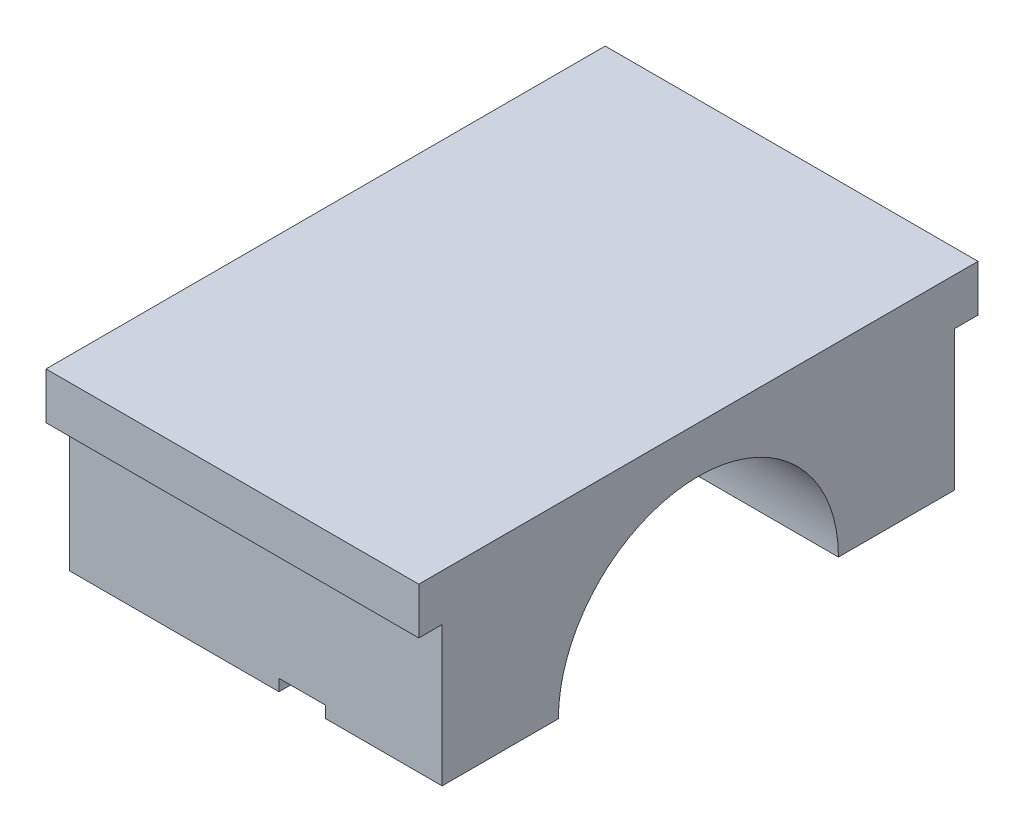
ISO-10303-21;
HEADER;
FILE_DESCRIPTION(('STEP AP214'),'2;1');
FILE_NAME('part.step','',(''),(''),'','','');
FILE_SCHEMA(('AUTOMOTIVE_DESIGN { 1 0 10303 214 1 1 1 1 }'));
ENDSEC;
DATA;
#1=APPLICATION_CONTEXT('core data for automotive mechanical design processes');
#2=APPLICATION_PROTOCOL_DEFINITION('international standard','automotive_design',2000,#1);
#3=PRODUCT_CONTEXT('',#1,'mechanical');
#4=PRODUCT('Part','Part','',(#3));
#5=PRODUCT_RELATED_PRODUCT_CATEGORY('part','',(#4));
#6=PRODUCT_DEFINITION_FORMATION('','',#4);
#7=PRODUCT_DEFINITION_CONTEXT('part definition',#1,'design');
#8=PRODUCT_DEFINITION('design','',#6,#7);
#9=PRODUCT_DEFINITION_SHAPE('','',#8);
#10=(LENGTH_UNIT() NAMED_UNIT(*) SI_UNIT(.MILLI.,.METRE.));
#11=(NAMED_UNIT(*) PLANE_ANGLE_UNIT() SI_UNIT($,.RADIAN.));
#12=(NAMED_UNIT(*) SI_UNIT($,.STERADIAN.) SOLID_ANGLE_UNIT());
#13=UNCERTAINTY_MEASURE_WITH_UNIT(LENGTH_MEASURE(1.E-05),#10,'distance_accuracy_value','');
#14=(GEOMETRIC_REPRESENTATION_CONTEXT(3) GLOBAL_UNCERTAINTY_ASSIGNED_CONTEXT((#13)) GLOBAL_UNIT_ASSIGNED_CONTEXT((#10,
#11,#12)) REPRESENTATION_CONTEXT('',''));
#15=CARTESIAN_POINT('',(0.,0.,0.));
#16=DIRECTION('',(0.,0.,1.));
#17=DIRECTION('',(1.,0.,0.));
#18=AXIS2_PLACEMENT_3D('',#15,#16,#17);
#19=CARTESIAN_POINT('',(1041.4,0.,0.));
#20=DIRECTION('',(0.,-1.,0.));
#21=DIRECTION('',(0.,0.,-1.));
#22=AXIS2_PLACEMENT_3D('',#19,#20,#21);
#23=PLANE('',#22);
#24=DIRECTION('',(0.,0.,-1.));
#25=VECTOR('',#24,1.);
#26=CARTESIAN_POINT('',(952.5,0.,114.3));
#27=LINE('',#26,#25);
#28=CARTESIAN_POINT('',(952.5,0.,139.7));
#29=VERTEX_POINT('',#28);
#30=CARTESIAN_POINT('',(952.5,0.,114.3));
#31=VERTEX_POINT('',#30);
#32=EDGE_CURVE('E180',#29,#31,#27,.T.);
#33=ORIENTED_EDGE('',*,*,#32,.F.);
#34=DIRECTION('',(-1.,0.,0.));
#35=VECTOR('',#34,1.);
#36=CARTESIAN_POINT('',(1041.4,0.,139.7));
#37=LINE('',#36,#35);
#38=CARTESIAN_POINT('',(838.2,0.,139.7));
#39=VERTEX_POINT('',#38);
#40=EDGE_CURVE('E53',#29,#39,#37,.T.);
#41=ORIENTED_EDGE('',*,*,#40,.T.);
#42=DIRECTION('',(0.,0.,1.));
#43=VECTOR('',#42,1.);
#44=CARTESIAN_POINT('',(838.2,0.,0.));
#45=LINE('',#44,#43);
#46=CARTESIAN_POINT('',(838.2,0.,76.3270000000002));
#47=VERTEX_POINT('',#46);
#48=EDGE_CURVE('E292',#47,#39,#45,.T.);
#49=ORIENTED_EDGE('',*,*,#48,.F.);
#50=DIRECTION('',(-1.,0.,0.));
#51=VECTOR('',#50,1.);
#52=CARTESIAN_POINT('',(0.,0.,76.3270000000002));
#53=LINE('',#52,#51);
#54=CARTESIAN_POINT('',(1041.4,0.,76.3270000000002));
#55=VERTEX_POINT('',#54);
#56=EDGE_CURVE('E264',#55,#47,#53,.T.);
#57=ORIENTED_EDGE('',*,*,#56,.F.);
#58=DIRECTION('',(0.,0.,1.));
#59=VECTOR('',#58,1.);
#60=CARTESIAN_POINT('',(1041.4,0.,0.));
#61=LINE('',#60,#59);
#62=CARTESIAN_POINT('',(1041.4,0.,139.7));
#63=VERTEX_POINT('',#62);
#64=EDGE_CURVE('E270',#55,#63,#61,.T.);
#65=ORIENTED_EDGE('',*,*,#64,.T.);
#66=CARTESIAN_POINT('',(977.9,0.,139.7));
#67=VERTEX_POINT('',#66);
#68=EDGE_CURVE('E12',#63,#67,#37,.T.);
#69=ORIENTED_EDGE('',*,*,#68,.T.);
#70=DIRECTION('',(0.,0.,1.));
#71=VECTOR('',#70,1.);
#72=CARTESIAN_POINT('',(977.9,0.,139.7));
#73=LINE('',#72,#71);
#74=CARTESIAN_POINT('',(977.9,0.,114.3));
#75=VERTEX_POINT('',#74);
#76=EDGE_CURVE('E193',#75,#67,#73,.T.);
#77=ORIENTED_EDGE('',*,*,#76,.F.);
#78=CARTESIAN_POINT('',(965.2,0.,114.3));
#79=DIRECTION('',(0.,-1.,0.));
#80=DIRECTION('',(0.,0.,1.));
#81=AXIS2_PLACEMENT_3D('',#78,#79,#80);
#82=CIRCLE('',#81,12.7);
#83=EDGE_CURVE('E195',#31,#75,#82,.T.);
#84=ORIENTED_EDGE('',*,*,#83,.F.);
#85=EDGE_LOOP('',(#33,#41,#49,#57,#65,#69,#77,#84));
#86=FACE_BOUND('',#85,.T.);
#87=CARTESIAN_POINT('',(914.4,0.,101.6));
#88=DIRECTION('',(0.,-1.,0.));
#89=DIRECTION('',(0.,0.,-1.));
#90=AXIS2_PLACEMENT_3D('',#87,#88,#89);
#91=CIRCLE('',#90,3.17500000000008);
#92=CARTESIAN_POINT('',(914.4,0.,98.4249999999999));
#93=VERTEX_POINT('',#92);
#94=EDGE_CURVE('E243',#93,#93,#91,.T.);
#95=ORIENTED_EDGE('',*,*,#94,.F.);
#96=EDGE_LOOP('',(#95));
#97=FACE_BOUND('',#96,.T.);
#98=ADVANCED_FACE('F45',(#86,#97),#23,.T.);
#99=CARTESIAN_POINT('',(1041.4,0.,139.7));
#100=DIRECTION('',(0.,0.,1.));
#101=DIRECTION('',(1.,0.,0.));
#102=AXIS2_PLACEMENT_3D('',#99,#100,#101);
#103=PLANE('',#102);
#104=DIRECTION('',(0.,-1.,0.));
#105=VECTOR('',#104,1.);
#106=CARTESIAN_POINT('',(952.5,6.35000000000001,139.7));
#107=LINE('',#106,#105);
#108=CARTESIAN_POINT('',(952.5,6.35000000000001,139.7));
#109=VERTEX_POINT('',#108);
#110=EDGE_CURVE('E202',#109,#29,#107,.T.);
#111=ORIENTED_EDGE('',*,*,#110,.F.);
#112=DIRECTION('',(-1.,0.,0.));
#113=VECTOR('',#112,1.);
#114=CARTESIAN_POINT('',(952.5,6.35000000000001,139.7));
#115=LINE('',#114,#113);
#116=CARTESIAN_POINT('',(977.9,6.35000000000001,139.7));
#117=VERTEX_POINT('',#116);
#118=EDGE_CURVE('E185',#117,#109,#115,.T.);
#119=ORIENTED_EDGE('',*,*,#118,.F.);
#120=DIRECTION('',(0.,-1.,0.));
#121=VECTOR('',#120,1.);
#122=CARTESIAN_POINT('',(977.9,6.35000000000001,139.7));
#123=LINE('',#122,#121);
#124=EDGE_CURVE('E205',#117,#67,#123,.T.);
#125=ORIENTED_EDGE('',*,*,#124,.T.);
#126=ORIENTED_EDGE('',*,*,#68,.F.);
#127=DIRECTION('',(0.,1.,0.));
#128=VECTOR('',#127,1.);
#129=CARTESIAN_POINT('',(1041.4,0.,139.7));
#130=LINE('',#129,#128);
#131=CARTESIAN_POINT('',(1041.4,76.1999999999999,139.7));
#132=VERTEX_POINT('',#131);
#133=EDGE_CURVE('E267',#63,#132,#130,.T.);
#134=ORIENTED_EDGE('',*,*,#133,.T.);
#135=DIRECTION('',(-1.,0.,0.));
#136=VECTOR('',#135,1.);
#137=CARTESIAN_POINT('',(1041.4,76.1999999999999,139.7));
#138=LINE('',#137,#136);
#139=CARTESIAN_POINT('',(838.2,76.1999999999999,139.7));
#140=VERTEX_POINT('',#139);
#141=EDGE_CURVE('E289',#132,#140,#138,.T.);
#142=ORIENTED_EDGE('',*,*,#141,.T.);
#143=DIRECTION('',(0.,1.,0.));
#144=VECTOR('',#143,1.);
#145=CARTESIAN_POINT('',(838.2,0.,139.7));
#146=LINE('',#145,#144);
#147=EDGE_CURVE('E266',#39,#140,#146,.T.);
#148=ORIENTED_EDGE('',*,*,#147,.F.);
#149=ORIENTED_EDGE('',*,*,#40,.F.);
#150=EDGE_LOOP('',(#111,#119,#125,#126,#134,#142,#148,#149));
#151=FACE_BOUND('',#150,.T.);
#152=ADVANCED_FACE('F47',(#151),#103,.T.);
#153=DIRECTION('',(0.,0.,-1.));
#154=VECTOR('',#153,1.);
#155=CARTESIAN_POINT('',(952.5,0.,-139.7));
#156=LINE('',#155,#154);
#157=CARTESIAN_POINT('',(952.5,0.,-114.3));
#158=VERTEX_POINT('',#157);
#159=CARTESIAN_POINT('',(952.5,0.,-139.7));
#160=VERTEX_POINT('',#159);
#161=EDGE_CURVE('E212',#158,#160,#156,.T.);
#162=ORIENTED_EDGE('',*,*,#161,.F.);
#163=CARTESIAN_POINT('',(965.2,0.,-114.3));
#164=DIRECTION('',(0.,-1.,0.));
#165=DIRECTION('',(0.,0.,1.));
#166=AXIS2_PLACEMENT_3D('',#163,#164,#165);
#167=CIRCLE('',#166,12.7);
#168=CARTESIAN_POINT('',(977.9,0.,-114.3));
#169=VERTEX_POINT('',#168);
#170=EDGE_CURVE('E221',#169,#158,#167,.T.);
#171=ORIENTED_EDGE('',*,*,#170,.F.);
#172=DIRECTION('',(0.,0.,1.));
#173=VECTOR('',#172,1.);
#174=CARTESIAN_POINT('',(977.9,0.,-114.3));
#175=LINE('',#174,#173);
#176=CARTESIAN_POINT('',(977.9,0.,-139.7));
#177=VERTEX_POINT('',#176);
#178=EDGE_CURVE('E204',#177,#169,#175,.T.);
#179=ORIENTED_EDGE('',*,*,#178,.F.);
#180=DIRECTION('',(-1.,0.,0.));
#181=VECTOR('',#180,1.);
#182=CARTESIAN_POINT('',(1041.4,0.,-139.7));
#183=LINE('',#182,#181);
#184=CARTESIAN_POINT('',(1041.4,0.,-139.7));
#185=VERTEX_POINT('',#184);
#186=EDGE_CURVE('E325',#185,#177,#183,.T.);
#187=ORIENTED_EDGE('',*,*,#186,.F.);
#188=CARTESIAN_POINT('',(1041.4,0.,-76.3270000000002));
#189=VERTEX_POINT('',#188);
#190=EDGE_CURVE('E272',#185,#189,#61,.T.);
#191=ORIENTED_EDGE('',*,*,#190,.T.);
#192=DIRECTION('',(-1.,0.,0.));
#193=VECTOR('',#192,1.);
#194=CARTESIAN_POINT('',(0.,0.,-76.3270000000002));
#195=LINE('',#194,#193);
#196=CARTESIAN_POINT('',(838.2,0.,-76.3270000000002));
#197=VERTEX_POINT('',#196);
#198=EDGE_CURVE('E262',#197,#189,#195,.F.);
#199=ORIENTED_EDGE('',*,*,#198,.F.);
#200=CARTESIAN_POINT('',(838.2,0.,-139.7));
#201=VERTEX_POINT('',#200);
#202=EDGE_CURVE('E293',#201,#197,#45,.T.);
#203=ORIENTED_EDGE('',*,*,#202,.F.);
#204=EDGE_CURVE('E324',#160,#201,#183,.T.);
#205=ORIENTED_EDGE('',*,*,#204,.F.);
#206=EDGE_LOOP('',(#162,#171,#179,#187,#191,#199,#203,#205));
#207=FACE_BOUND('',#206,.T.);
#208=CARTESIAN_POINT('',(914.4,0.,-101.6));
#209=DIRECTION('',(0.,-1.,0.));
#210=DIRECTION('',(0.,0.,-1.));
#211=AXIS2_PLACEMENT_3D('',#208,#209,#210);
#212=CIRCLE('',#211,3.17500000000008);
#213=CARTESIAN_POINT('',(914.4,0.,-104.775));
#214=VERTEX_POINT('',#213);
#215=EDGE_CURVE('E249',#214,#214,#212,.T.);
#216=ORIENTED_EDGE('',*,*,#215,.F.);
#217=EDGE_LOOP('',(#216));
#218=FACE_BOUND('',#217,.T.);
#219=ADVANCED_FACE('F344',(#207,#218),#23,.T.);
#220=CARTESIAN_POINT('',(1041.4,0.,-139.7));
#221=DIRECTION('',(0.,0.,1.));
#222=DIRECTION('',(1.,0.,0.));
#223=AXIS2_PLACEMENT_3D('',#220,#221,#222);
#224=PLANE('',#223);
#225=DIRECTION('',(1.,0.,0.));
#226=VECTOR('',#225,1.);
#227=CARTESIAN_POINT('',(977.9,6.34999999999999,-139.7));
#228=LINE('',#227,#226);
#229=CARTESIAN_POINT('',(952.5,6.34999999999999,-139.7));
#230=VERTEX_POINT('',#229);
#231=CARTESIAN_POINT('',(977.9,6.34999999999999,-139.7));
#232=VERTEX_POINT('',#231);
#233=EDGE_CURVE('E209',#230,#232,#228,.T.);
#234=ORIENTED_EDGE('',*,*,#233,.F.);
#235=DIRECTION('',(0.,-1.,0.));
#236=VECTOR('',#235,1.);
#237=CARTESIAN_POINT('',(952.5,6.34999999999999,-139.7));
#238=LINE('',#237,#236);
#239=EDGE_CURVE('E225',#230,#160,#238,.T.);
#240=ORIENTED_EDGE('',*,*,#239,.T.);
#241=ORIENTED_EDGE('',*,*,#204,.T.);
#242=DIRECTION('',(0.,1.,0.));
#243=VECTOR('',#242,1.);
#244=CARTESIAN_POINT('',(838.2,0.,-139.7));
#245=LINE('',#244,#243);
#246=CARTESIAN_POINT('',(838.2,76.1999999999999,-139.7));
#247=VERTEX_POINT('',#246);
#248=EDGE_CURVE('E295',#201,#247,#245,.T.);
#249=ORIENTED_EDGE('',*,*,#248,.T.);
#250=DIRECTION('',(-1.,0.,0.));
#251=VECTOR('',#250,1.);
#252=CARTESIAN_POINT('',(1041.4,76.1999999999999,-139.7));
#253=LINE('',#252,#251);
#254=CARTESIAN_POINT('',(1041.4,76.1999999999999,-139.7));
#255=VERTEX_POINT('',#254);
#256=EDGE_CURVE('E323',#255,#247,#253,.T.);
#257=ORIENTED_EDGE('',*,*,#256,.F.);
#258=DIRECTION('',(0.,1.,0.));
#259=VECTOR('',#258,1.);
#260=CARTESIAN_POINT('',(1041.4,0.,-139.7));
#261=LINE('',#260,#259);
#262=EDGE_CURVE('E275',#185,#255,#261,.T.);
#263=ORIENTED_EDGE('',*,*,#262,.F.);
#264=ORIENTED_EDGE('',*,*,#186,.T.);
#265=DIRECTION('',(0.,-1.,0.));
#266=VECTOR('',#265,1.);
#267=CARTESIAN_POINT('',(977.9,6.34999999999999,-139.7));
#268=LINE('',#267,#266);
#269=EDGE_CURVE('E218',#232,#177,#268,.T.);
#270=ORIENTED_EDGE('',*,*,#269,.F.);
#271=EDGE_LOOP('',(#234,#240,#241,#249,#257,#263,#264,#270));
#272=FACE_BOUND('',#271,.T.);
#273=ADVANCED_FACE('F333',(#272),#224,.F.);
#274=CARTESIAN_POINT('',(1041.4,76.1999999999998,0.));
#275=DIRECTION('',(0.,-1.,0.));
#276=DIRECTION('',(0.,0.,-1.));
#277=AXIS2_PLACEMENT_3D('',#274,#275,#276);
#278=PLANE('',#277);
#279=DIRECTION('',(0.,0.,1.));
#280=VECTOR('',#279,1.);
#281=CARTESIAN_POINT('',(838.2,76.1999999999998,0.));
#282=LINE('',#281,#280);
#283=CARTESIAN_POINT('',(838.2,76.2,-152.4));
#284=VERTEX_POINT('',#283);
#285=EDGE_CURVE('E298',#284,#247,#282,.T.);
#286=ORIENTED_EDGE('',*,*,#285,.F.);
#287=DIRECTION('',(-1.,0.,0.));
#288=VECTOR('',#287,1.);
#289=CARTESIAN_POINT('',(1041.4,76.2,-152.4));
#290=LINE('',#289,#288);
#291=CARTESIAN_POINT('',(1041.4,76.2,-152.4));
#292=VERTEX_POINT('',#291);
#293=EDGE_CURVE('E321',#292,#284,#290,.T.);
#294=ORIENTED_EDGE('',*,*,#293,.F.);
#295=DIRECTION('',(0.,0.,1.));
#296=VECTOR('',#295,1.);
#297=CARTESIAN_POINT('',(1041.4,76.1999999999998,0.));
#298=LINE('',#297,#296);
#299=EDGE_CURVE('E277',#292,#255,#298,.T.);
#300=ORIENTED_EDGE('',*,*,#299,.T.);
#301=ORIENTED_EDGE('',*,*,#256,.T.);
#302=EDGE_LOOP('',(#286,#294,#300,#301));
#303=FACE_BOUND('',#302,.T.);
#304=ADVANCED_FACE('F382',(#303),#278,.T.);
#305=CARTESIAN_POINT('',(1041.4,0.,-152.4));
#306=DIRECTION('',(0.,0.,1.));
#307=DIRECTION('',(1.,0.,0.));
#308=AXIS2_PLACEMENT_3D('',#305,#306,#307);
#309=PLANE('',#308);
#310=DIRECTION('',(0.,1.,0.));
#311=VECTOR('',#310,1.);
#312=CARTESIAN_POINT('',(838.2,0.,-152.4));
#313=LINE('',#312,#311);
#314=CARTESIAN_POINT('',(838.2,101.6,-152.4));
#315=VERTEX_POINT('',#314);
#316=EDGE_CURVE('E301',#284,#315,#313,.T.);
#317=ORIENTED_EDGE('',*,*,#316,.T.);
#318=DIRECTION('',(-1.,0.,0.));
#319=VECTOR('',#318,1.);
#320=CARTESIAN_POINT('',(1041.4,101.6,-152.4));
#321=LINE('',#320,#319);
#322=CARTESIAN_POINT('',(1041.4,101.6,-152.4));
#323=VERTEX_POINT('',#322);
#324=EDGE_CURVE('E317',#323,#315,#321,.T.);
#325=ORIENTED_EDGE('',*,*,#324,.F.);
#326=DIRECTION('',(0.,1.,0.));
#327=VECTOR('',#326,1.);
#328=CARTESIAN_POINT('',(1041.4,0.,-152.4));
#329=LINE('',#328,#327);
#330=EDGE_CURVE('E280',#292,#323,#329,.T.);
#331=ORIENTED_EDGE('',*,*,#330,.F.);
#332=ORIENTED_EDGE('',*,*,#293,.T.);
#333=EDGE_LOOP('',(#317,#325,#331,#332));
#334=FACE_BOUND('',#333,.T.);
#335=ADVANCED_FACE('F385',(#334),#309,.F.);
#336=CARTESIAN_POINT('',(1041.4,101.6,0.));
#337=DIRECTION('',(0.,-1.,0.));
#338=DIRECTION('',(0.,0.,-1.));
#339=AXIS2_PLACEMENT_3D('',#336,#337,#338);
#340=PLANE('',#339);
#341=DIRECTION('',(0.,0.,1.));
#342=VECTOR('',#341,1.);
#343=CARTESIAN_POINT('',(838.2,101.6,0.));
#344=LINE('',#343,#342);
#345=CARTESIAN_POINT('',(838.2,101.6,152.4));
#346=VERTEX_POINT('',#345);
#347=EDGE_CURVE('E303',#315,#346,#344,.T.);
#348=ORIENTED_EDGE('',*,*,#347,.T.);
#349=DIRECTION('',(-1.,0.,0.));
#350=VECTOR('',#349,1.);
#351=CARTESIAN_POINT('',(1041.4,101.6,152.4));
#352=LINE('',#351,#350);
#353=CARTESIAN_POINT('',(1041.4,101.6,152.4));
#354=VERTEX_POINT('',#353);
#355=EDGE_CURVE('E315',#354,#346,#352,.T.);
#356=ORIENTED_EDGE('',*,*,#355,.F.);
#357=DIRECTION('',(0.,0.,1.));
#358=VECTOR('',#357,1.);
#359=CARTESIAN_POINT('',(1041.4,101.6,0.));
#360=LINE('',#359,#358);
#361=EDGE_CURVE('E282',#323,#354,#360,.T.);
#362=ORIENTED_EDGE('',*,*,#361,.F.);
#363=ORIENTED_EDGE('',*,*,#324,.T.);
#364=EDGE_LOOP('',(#348,#356,#362,#363));
#365=FACE_BOUND('',#364,.T.);
#366=ADVANCED_FACE('F378',(#365),#340,.F.);
#367=CARTESIAN_POINT('',(1041.4,0.,152.4));
#368=DIRECTION('',(0.,0.,1.));
#369=DIRECTION('',(1.,0.,0.));
#370=AXIS2_PLACEMENT_3D('',#367,#368,#369);
#371=PLANE('',#370);
#372=DIRECTION('',(0.,1.,0.));
#373=VECTOR('',#372,1.);
#374=CARTESIAN_POINT('',(838.2,0.,152.4));
#375=LINE('',#374,#373);
#376=CARTESIAN_POINT('',(838.2,76.2,152.4));
#377=VERTEX_POINT('',#376);
#378=EDGE_CURVE('E307',#377,#346,#375,.T.);
#379=ORIENTED_EDGE('',*,*,#378,.F.);
#380=DIRECTION('',(-1.,0.,0.));
#381=VECTOR('',#380,1.);
#382=CARTESIAN_POINT('',(1041.4,76.2,152.4));
#383=LINE('',#382,#381);
#384=CARTESIAN_POINT('',(1041.4,76.2,152.4));
#385=VERTEX_POINT('',#384);
#386=EDGE_CURVE('E313',#385,#377,#383,.T.);
#387=ORIENTED_EDGE('',*,*,#386,.F.);
#388=DIRECTION('',(0.,1.,0.));
#389=VECTOR('',#388,1.);
#390=CARTESIAN_POINT('',(1041.4,0.,152.4));
#391=LINE('',#390,#389);
#392=EDGE_CURVE('E284',#385,#354,#391,.T.);
#393=ORIENTED_EDGE('',*,*,#392,.T.);
#394=ORIENTED_EDGE('',*,*,#355,.T.);
#395=EDGE_LOOP('',(#379,#387,#393,#394));
#396=FACE_BOUND('',#395,.T.);
#397=ADVANCED_FACE('F372',(#396),#371,.T.);
#398=CARTESIAN_POINT('',(1041.4,76.1999999999998,0.));
#399=DIRECTION('',(0.,1.,0.));
#400=DIRECTION('',(0.,0.,1.));
#401=AXIS2_PLACEMENT_3D('',#398,#399,#400);
#402=PLANE('',#401);
#403=DIRECTION('',(0.,0.,-1.));
#404=VECTOR('',#403,1.);
#405=CARTESIAN_POINT('',(838.2,76.1999999999998,0.));
#406=LINE('',#405,#404);
#407=EDGE_CURVE('E271',#377,#140,#406,.T.);
#408=ORIENTED_EDGE('',*,*,#407,.T.);
#409=ORIENTED_EDGE('',*,*,#141,.F.);
#410=DIRECTION('',(0.,0.,-1.));
#411=VECTOR('',#410,1.);
#412=CARTESIAN_POINT('',(1041.4,76.1999999999998,0.));
#413=LINE('',#412,#411);
#414=EDGE_CURVE('E287',#385,#132,#413,.T.);
#415=ORIENTED_EDGE('',*,*,#414,.F.);
#416=ORIENTED_EDGE('',*,*,#386,.T.);
#417=EDGE_LOOP('',(#408,#409,#415,#416));
#418=FACE_BOUND('',#417,.T.);
#419=ADVANCED_FACE('F430',(#418),#402,.F.);
#420=CARTESIAN_POINT('',(1041.4,0.,0.));
#421=DIRECTION('',(1.,0.,0.));
#422=DIRECTION('',(0.,0.,-1.));
#423=AXIS2_PLACEMENT_3D('',#420,#421,#422);
#424=PLANE('',#423);
#425=CARTESIAN_POINT('',(1041.4,0.,0.));
#426=DIRECTION('',(1.,0.,0.));
#427=DIRECTION('',(0.,0.,-1.));
#428=AXIS2_PLACEMENT_3D('',#425,#426,#427);
#429=CIRCLE('',#428,76.3270000000002);
#430=EDGE_CURVE('E260',#189,#55,#429,.T.);
#431=ORIENTED_EDGE('',*,*,#430,.F.);
#432=ORIENTED_EDGE('',*,*,#190,.F.);
#433=ORIENTED_EDGE('',*,*,#262,.T.);
#434=ORIENTED_EDGE('',*,*,#299,.F.);
#435=ORIENTED_EDGE('',*,*,#330,.T.);
#436=ORIENTED_EDGE('',*,*,#361,.T.);
#437=ORIENTED_EDGE('',*,*,#392,.F.);
#438=ORIENTED_EDGE('',*,*,#414,.T.);
#439=ORIENTED_EDGE('',*,*,#133,.F.);
#440=ORIENTED_EDGE('',*,*,#64,.F.);
#441=EDGE_LOOP('',(#431,#432,#433,#434,#435,#436,#437,#438,#439,#440));
#442=FACE_BOUND('',#441,.T.);
#443=ADVANCED_FACE('F353',(#442),#424,.T.);
#444=CARTESIAN_POINT('',(838.2,0.,0.));
#445=DIRECTION('',(1.,0.,0.));
#446=DIRECTION('',(0.,0.,-1.));
#447=AXIS2_PLACEMENT_3D('',#444,#445,#446);
#448=PLANE('',#447);
#449=CARTESIAN_POINT('',(838.2,25.3999999999999,101.6));
#450=DIRECTION('',(1.,0.,0.));
#451=DIRECTION('',(0.,0.,-1.));
#452=AXIS2_PLACEMENT_3D('',#449,#450,#451);
#453=CIRCLE('',#452,3.175);
#454=CARTESIAN_POINT('',(838.2,25.3999999999999,98.425));
#455=VERTEX_POINT('',#454);
#456=EDGE_CURVE('E228',#455,#455,#453,.T.);
#457=ORIENTED_EDGE('',*,*,#456,.T.);
#458=EDGE_LOOP('',(#457));
#459=FACE_BOUND('',#458,.T.);
#460=CARTESIAN_POINT('',(838.2,25.4,-101.6));
#461=DIRECTION('',(1.,0.,0.));
#462=DIRECTION('',(0.,0.,-1.));
#463=AXIS2_PLACEMENT_3D('',#460,#461,#462);
#464=CIRCLE('',#463,3.175);
#465=CARTESIAN_POINT('',(838.2,25.4,-104.775));
#466=VERTEX_POINT('',#465);
#467=EDGE_CURVE('E237',#466,#466,#464,.T.);
#468=ORIENTED_EDGE('',*,*,#467,.T.);
#469=EDGE_LOOP('',(#468));
#470=FACE_BOUND('',#469,.T.);
#471=ORIENTED_EDGE('',*,*,#202,.T.);
#472=CARTESIAN_POINT('',(838.2,0.,0.));
#473=DIRECTION('',(-1.,0.,0.));
#474=DIRECTION('',(0.,-1.,0.));
#475=AXIS2_PLACEMENT_3D('',#472,#473,#474);
#476=CIRCLE('',#475,76.3270000000002);
#477=EDGE_CURVE('E255',#47,#197,#476,.T.);
#478=ORIENTED_EDGE('',*,*,#477,.F.);
#479=ORIENTED_EDGE('',*,*,#48,.T.);
#480=ORIENTED_EDGE('',*,*,#147,.T.);
#481=ORIENTED_EDGE('',*,*,#407,.F.);
#482=ORIENTED_EDGE('',*,*,#378,.T.);
#483=ORIENTED_EDGE('',*,*,#347,.F.);
#484=ORIENTED_EDGE('',*,*,#316,.F.);
#485=ORIENTED_EDGE('',*,*,#285,.T.);
#486=ORIENTED_EDGE('',*,*,#248,.F.);
#487=EDGE_LOOP('',(#471,#478,#479,#480,#481,#482,#483,#484,#485,#486));
#488=FACE_BOUND('',#487,.T.);
#489=ADVANCED_FACE('F339',(#459,#470,#488),#448,.F.);
#490=CARTESIAN_POINT('',(0.,0.,0.));
#491=DIRECTION('',(-1.,0.,0.));
#492=DIRECTION('',(0.,-1.,0.));
#493=AXIS2_PLACEMENT_3D('',#490,#491,#492);
#494=CYLINDRICAL_SURFACE('',#493,76.3270000000002);
#495=ORIENTED_EDGE('',*,*,#56,.T.);
#496=ORIENTED_EDGE('',*,*,#477,.T.);
#497=ORIENTED_EDGE('',*,*,#198,.T.);
#498=ORIENTED_EDGE('',*,*,#430,.T.);
#499=EDGE_LOOP('',(#495,#496,#497,#498));
#500=FACE_BOUND('',#499,.T.);
#501=ADVANCED_FACE('F349',(#500),#494,.F.);
#502=CARTESIAN_POINT('',(914.4,25.4,-101.6));
#503=DIRECTION('',(0.,-1.,0.));
#504=DIRECTION('',(0.,0.,-1.));
#505=AXIS2_PLACEMENT_3D('',#502,#503,#504);
#506=CYLINDRICAL_SURFACE('',#505,3.17500000000008);
#507=CARTESIAN_POINT('',(914.4,25.4,-101.6));
#508=DIRECTION('',(0.,-1.,0.));
#509=DIRECTION('',(0.,0.,-1.));
#510=AXIS2_PLACEMENT_3D('',#507,#508,#509);
#511=CIRCLE('',#510,3.17500000000008);
#512=CARTESIAN_POINT('',(914.4,25.4,-104.775));
#513=VERTEX_POINT('',#512);
#514=EDGE_CURVE('E252',#513,#513,#511,.T.);
#515=ORIENTED_EDGE('',*,*,#514,.F.);
#516=EDGE_LOOP('',(#515));
#517=FACE_BOUND('',#516,.T.);
#518=ORIENTED_EDGE('',*,*,#215,.T.);
#519=EDGE_LOOP('',(#518));
#520=FACE_BOUND('',#519,.T.);
#521=ADVANCED_FACE('F457',(#517,#520),#506,.F.);
#522=CARTESIAN_POINT('',(914.4,25.4,-101.6));
#523=DIRECTION('',(0.,-1.,0.));
#524=DIRECTION('',(0.,0.,-1.));
#525=AXIS2_PLACEMENT_3D('',#522,#523,#524);
#526=PLANE('',#525);
#527=ORIENTED_EDGE('',*,*,#514,.T.);
#528=EDGE_LOOP('',(#527));
#529=FACE_BOUND('',#528,.T.);
#530=ADVANCED_FACE('F467',(#529),#526,.T.);
#531=CARTESIAN_POINT('',(914.4,25.4,101.6));
#532=DIRECTION('',(0.,-1.,0.));
#533=DIRECTION('',(0.,0.,-1.));
#534=AXIS2_PLACEMENT_3D('',#531,#532,#533);
#535=CYLINDRICAL_SURFACE('',#534,3.17500000000008);
#536=CARTESIAN_POINT('',(914.4,25.4,101.6));
#537=DIRECTION('',(0.,-1.,0.));
#538=DIRECTION('',(0.,0.,-1.));
#539=AXIS2_PLACEMENT_3D('',#536,#537,#538);
#540=CIRCLE('',#539,3.17500000000008);
#541=CARTESIAN_POINT('',(914.4,25.4,98.4249999999999));
#542=VERTEX_POINT('',#541);
#543=EDGE_CURVE('E246',#542,#542,#540,.T.);
#544=ORIENTED_EDGE('',*,*,#543,.F.);
#545=EDGE_LOOP('',(#544));
#546=FACE_BOUND('',#545,.T.);
#547=ORIENTED_EDGE('',*,*,#94,.T.);
#548=EDGE_LOOP('',(#547));
#549=FACE_BOUND('',#548,.T.);
#550=ADVANCED_FACE('F477',(#546,#549),#535,.F.);
#551=CARTESIAN_POINT('',(914.4,25.4,101.6));
#552=DIRECTION('',(0.,-1.,0.));
#553=DIRECTION('',(0.,0.,-1.));
#554=AXIS2_PLACEMENT_3D('',#551,#552,#553);
#555=PLANE('',#554);
#556=ORIENTED_EDGE('',*,*,#543,.T.);
#557=EDGE_LOOP('',(#556));
#558=FACE_BOUND('',#557,.T.);
#559=ADVANCED_FACE('F487',(#558),#555,.T.);
#560=CARTESIAN_POINT('',(863.6,25.4,-101.6));
#561=DIRECTION('',(-1.,0.,0.));
#562=DIRECTION('',(0.,0.,1.));
#563=AXIS2_PLACEMENT_3D('',#560,#561,#562);
#564=CYLINDRICAL_SURFACE('',#563,3.175);
#565=CARTESIAN_POINT('',(863.6,25.4,-101.6));
#566=DIRECTION('',(1.,0.,0.));
#567=DIRECTION('',(0.,0.,-1.));
#568=AXIS2_PLACEMENT_3D('',#565,#566,#567);
#569=CIRCLE('',#568,3.175);
#570=CARTESIAN_POINT('',(863.6,25.4,-104.775));
#571=VERTEX_POINT('',#570);
#572=EDGE_CURVE('E240',#571,#571,#569,.T.);
#573=ORIENTED_EDGE('',*,*,#572,.T.);
#574=EDGE_LOOP('',(#573));
#575=FACE_BOUND('',#574,.T.);
#576=ORIENTED_EDGE('',*,*,#467,.F.);
#577=EDGE_LOOP('',(#576));
#578=FACE_BOUND('',#577,.T.);
#579=ADVANCED_FACE('F497',(#575,#578),#564,.F.);
#580=CARTESIAN_POINT('',(863.6,25.4,-101.6));
#581=DIRECTION('',(1.,0.,0.));
#582=DIRECTION('',(0.,0.,-1.));
#583=AXIS2_PLACEMENT_3D('',#580,#581,#582);
#584=PLANE('',#583);
#585=ORIENTED_EDGE('',*,*,#572,.F.);
#586=EDGE_LOOP('',(#585));
#587=FACE_BOUND('',#586,.T.);
#588=ADVANCED_FACE('F513',(#587),#584,.F.);
#589=CARTESIAN_POINT('',(863.6,25.3999999999999,101.6));
#590=DIRECTION('',(-1.,0.,0.));
#591=DIRECTION('',(0.,0.,1.));
#592=AXIS2_PLACEMENT_3D('',#589,#590,#591);
#593=CYLINDRICAL_SURFACE('',#592,3.175);
#594=CARTESIAN_POINT('',(863.6,25.3999999999999,101.6));
#595=DIRECTION('',(1.,0.,0.));
#596=DIRECTION('',(0.,0.,-1.));
#597=AXIS2_PLACEMENT_3D('',#594,#595,#596);
#598=CIRCLE('',#597,3.175);
#599=CARTESIAN_POINT('',(863.6,25.3999999999999,98.425));
#600=VERTEX_POINT('',#599);
#601=EDGE_CURVE('E234',#600,#600,#598,.T.);
#602=ORIENTED_EDGE('',*,*,#601,.T.);
#603=EDGE_LOOP('',(#602));
#604=FACE_BOUND('',#603,.T.);
#605=ORIENTED_EDGE('',*,*,#456,.F.);
#606=EDGE_LOOP('',(#605));
#607=FACE_BOUND('',#606,.T.);
#608=ADVANCED_FACE('F523',(#604,#607),#593,.F.);
#609=CARTESIAN_POINT('',(863.6,25.3999999999999,101.6));
#610=DIRECTION('',(1.,0.,0.));
#611=DIRECTION('',(0.,0.,-1.));
#612=AXIS2_PLACEMENT_3D('',#609,#610,#611);
#613=PLANE('',#612);
#614=ORIENTED_EDGE('',*,*,#601,.F.);
#615=EDGE_LOOP('',(#614));
#616=FACE_BOUND('',#615,.T.);
#617=ADVANCED_FACE('F533',(#616),#613,.F.);
#618=CARTESIAN_POINT('',(952.5,6.34999999999999,-139.7));
#619=DIRECTION('',(-1.,0.,0.));
#620=DIRECTION('',(0.,0.,1.));
#621=AXIS2_PLACEMENT_3D('',#618,#619,#620);
#622=PLANE('',#621);
#623=ORIENTED_EDGE('',*,*,#161,.T.);
#624=ORIENTED_EDGE('',*,*,#239,.F.);
#625=DIRECTION('',(0.,0.,-1.));
#626=VECTOR('',#625,1.);
#627=CARTESIAN_POINT('',(952.5,6.34999999999999,-139.7));
#628=LINE('',#627,#626);
#629=CARTESIAN_POINT('',(952.5,6.34999999999999,-114.3));
#630=VERTEX_POINT('',#629);
#631=EDGE_CURVE('E68',#630,#230,#628,.T.);
#632=ORIENTED_EDGE('',*,*,#631,.F.);
#633=DIRECTION('',(0.,-1.,0.));
#634=VECTOR('',#633,1.);
#635=CARTESIAN_POINT('',(952.5,6.34999999999999,-114.3));
#636=LINE('',#635,#634);
#637=EDGE_CURVE('E229',#630,#158,#636,.T.);
#638=ORIENTED_EDGE('',*,*,#637,.T.);
#639=EDGE_LOOP('',(#623,#624,#632,#638));
#640=FACE_BOUND('',#639,.T.);
#641=ADVANCED_FACE('F542',(#640),#622,.F.);
#642=CARTESIAN_POINT('',(965.2,6.34999999999999,-114.3));
#643=DIRECTION('',(0.,-1.,0.));
#644=DIRECTION('',(0.,0.,-1.));
#645=AXIS2_PLACEMENT_3D('',#642,#643,#644);
#646=CYLINDRICAL_SURFACE('',#645,12.7);
#647=ORIENTED_EDGE('',*,*,#170,.T.);
#648=ORIENTED_EDGE('',*,*,#637,.F.);
#649=CARTESIAN_POINT('',(965.2,6.34999999999999,-114.3));
#650=DIRECTION('',(0.,-1.,0.));
#651=DIRECTION('',(0.,0.,1.));
#652=AXIS2_PLACEMENT_3D('',#649,#650,#651);
#653=CIRCLE('',#652,12.7);
#654=CARTESIAN_POINT('',(977.9,6.34999999999999,-114.3));
#655=VERTEX_POINT('',#654);
#656=EDGE_CURVE('E215',#655,#630,#653,.T.);
#657=ORIENTED_EDGE('',*,*,#656,.F.);
#658=DIRECTION('',(0.,-1.,0.));
#659=VECTOR('',#658,1.);
#660=CARTESIAN_POINT('',(977.9,6.34999999999999,-114.3));
#661=LINE('',#660,#659);
#662=EDGE_CURVE('E231',#655,#169,#661,.T.);
#663=ORIENTED_EDGE('',*,*,#662,.T.);
#664=EDGE_LOOP('',(#647,#648,#657,#663));
#665=FACE_BOUND('',#664,.T.);
#666=ADVANCED_FACE('F567',(#665),#646,.F.);
#667=CARTESIAN_POINT('',(977.9,6.34999999999999,-114.3));
#668=DIRECTION('',(1.,0.,0.));
#669=DIRECTION('',(0.,0.,-1.));
#670=AXIS2_PLACEMENT_3D('',#667,#668,#669);
#671=PLANE('',#670);
#672=ORIENTED_EDGE('',*,*,#178,.T.);
#673=ORIENTED_EDGE('',*,*,#662,.F.);
#674=DIRECTION('',(0.,0.,1.));
#675=VECTOR('',#674,1.);
#676=CARTESIAN_POINT('',(977.9,6.34999999999999,-114.3));
#677=LINE('',#676,#675);
#678=EDGE_CURVE('E211',#232,#655,#677,.T.);
#679=ORIENTED_EDGE('',*,*,#678,.F.);
#680=ORIENTED_EDGE('',*,*,#269,.T.);
#681=EDGE_LOOP('',(#672,#673,#679,#680));
#682=FACE_BOUND('',#681,.T.);
#683=ADVANCED_FACE('F574',(#682),#671,.F.);
#684=CARTESIAN_POINT('',(965.2,6.34999999999999,-114.3));
#685=DIRECTION('',(0.,1.,0.));
#686=DIRECTION('',(0.,0.,1.));
#687=AXIS2_PLACEMENT_3D('',#684,#685,#686);
#688=PLANE('',#687);
#689=ORIENTED_EDGE('',*,*,#233,.T.);
#690=ORIENTED_EDGE('',*,*,#678,.T.);
#691=ORIENTED_EDGE('',*,*,#656,.T.);
#692=ORIENTED_EDGE('',*,*,#631,.T.);
#693=EDGE_LOOP('',(#689,#690,#691,#692));
#694=FACE_BOUND('',#693,.T.);
#695=ADVANCED_FACE('F582',(#694),#688,.F.);
#696=CARTESIAN_POINT('',(952.5,6.35000000000001,114.3));
#697=DIRECTION('',(-1.,0.,0.));
#698=DIRECTION('',(0.,0.,1.));
#699=AXIS2_PLACEMENT_3D('',#696,#697,#698);
#700=PLANE('',#699);
#701=ORIENTED_EDGE('',*,*,#32,.T.);
#702=DIRECTION('',(0.,-1.,0.));
#703=VECTOR('',#702,1.);
#704=CARTESIAN_POINT('',(952.5,6.35000000000001,114.3));
#705=LINE('',#704,#703);
#706=CARTESIAN_POINT('',(952.5,6.35000000000001,114.3));
#707=VERTEX_POINT('',#706);
#708=EDGE_CURVE('E174',#707,#31,#705,.T.);
#709=ORIENTED_EDGE('',*,*,#708,.F.);
#710=DIRECTION('',(0.,0.,-1.));
#711=VECTOR('',#710,1.);
#712=CARTESIAN_POINT('',(952.5,6.35000000000001,114.3));
#713=LINE('',#712,#711);
#714=EDGE_CURVE('E178',#109,#707,#713,.T.);
#715=ORIENTED_EDGE('',*,*,#714,.F.);
#716=ORIENTED_EDGE('',*,*,#110,.T.);
#717=EDGE_LOOP('',(#701,#709,#715,#716));
#718=FACE_BOUND('',#717,.T.);
#719=ADVANCED_FACE('F176',(#718),#700,.F.);
#720=CARTESIAN_POINT('',(977.9,6.35000000000001,139.7));
#721=DIRECTION('',(1.,0.,0.));
#722=DIRECTION('',(0.,0.,-1.));
#723=AXIS2_PLACEMENT_3D('',#720,#721,#722);
#724=PLANE('',#723);
#725=ORIENTED_EDGE('',*,*,#76,.T.);
#726=ORIENTED_EDGE('',*,*,#124,.F.);
#727=DIRECTION('',(0.,0.,1.));
#728=VECTOR('',#727,1.);
#729=CARTESIAN_POINT('',(977.9,6.35000000000001,139.7));
#730=LINE('',#729,#728);
#731=CARTESIAN_POINT('',(977.9,6.35000000000001,114.3));
#732=VERTEX_POINT('',#731);
#733=EDGE_CURVE('E60',#732,#117,#730,.T.);
#734=ORIENTED_EDGE('',*,*,#733,.F.);
#735=DIRECTION('',(0.,-1.,0.));
#736=VECTOR('',#735,1.);
#737=CARTESIAN_POINT('',(977.9,6.35000000000001,114.3));
#738=LINE('',#737,#736);
#739=EDGE_CURVE('E184',#732,#75,#738,.T.);
#740=ORIENTED_EDGE('',*,*,#739,.T.);
#741=EDGE_LOOP('',(#725,#726,#734,#740));
#742=FACE_BOUND('',#741,.T.);
#743=ADVANCED_FACE('F362',(#742),#724,.F.);
#744=CARTESIAN_POINT('',(965.2,6.35000000000001,114.3));
#745=DIRECTION('',(0.,-1.,0.));
#746=DIRECTION('',(0.,0.,-1.));
#747=AXIS2_PLACEMENT_3D('',#744,#745,#746);
#748=CYLINDRICAL_SURFACE('',#747,12.7);
#749=ORIENTED_EDGE('',*,*,#83,.T.);
#750=ORIENTED_EDGE('',*,*,#739,.F.);
#751=CARTESIAN_POINT('',(965.2,6.35000000000001,114.3));
#752=DIRECTION('',(0.,-1.,0.));
#753=DIRECTION('',(0.,0.,1.));
#754=AXIS2_PLACEMENT_3D('',#751,#752,#753);
#755=CIRCLE('',#754,12.7);
#756=EDGE_CURVE('E187',#707,#732,#755,.T.);
#757=ORIENTED_EDGE('',*,*,#756,.F.);
#758=ORIENTED_EDGE('',*,*,#708,.T.);
#759=EDGE_LOOP('',(#749,#750,#757,#758));
#760=FACE_BOUND('',#759,.T.);
#761=ADVANCED_FACE('F188',(#760),#748,.F.);
#762=CARTESIAN_POINT('',(965.2,6.35000000000001,114.3));
#763=DIRECTION('',(0.,1.,0.));
#764=DIRECTION('',(0.,0.,1.));
#765=AXIS2_PLACEMENT_3D('',#762,#763,#764);
#766=PLANE('',#765);
#767=ORIENTED_EDGE('',*,*,#714,.T.);
#768=ORIENTED_EDGE('',*,*,#756,.T.);
#769=ORIENTED_EDGE('',*,*,#733,.T.);
#770=ORIENTED_EDGE('',*,*,#118,.T.);
#771=EDGE_LOOP('',(#767,#768,#769,#770));
#772=FACE_BOUND('',#771,.T.);
#773=ADVANCED_FACE('F190',(#772),#766,.F.);
#774=CLOSED_SHELL('',(#98,#152,#219,#273,#304,#335,#366,#397,#419,#443,#489,#501,#521,#530,#550,
#559,#579,#588,#608,#617,#641,#666,#683,#695,#719,#743,#761,#773));
#775=MANIFOLD_SOLID_BREP('B2',#774);
#776=ADVANCED_BREP_SHAPE_REPRESENTATION('',(#18,#775),#14);
#777=SHAPE_DEFINITION_REPRESENTATION(#9,#776);
ENDSEC;
END-ISO-10303-21;
